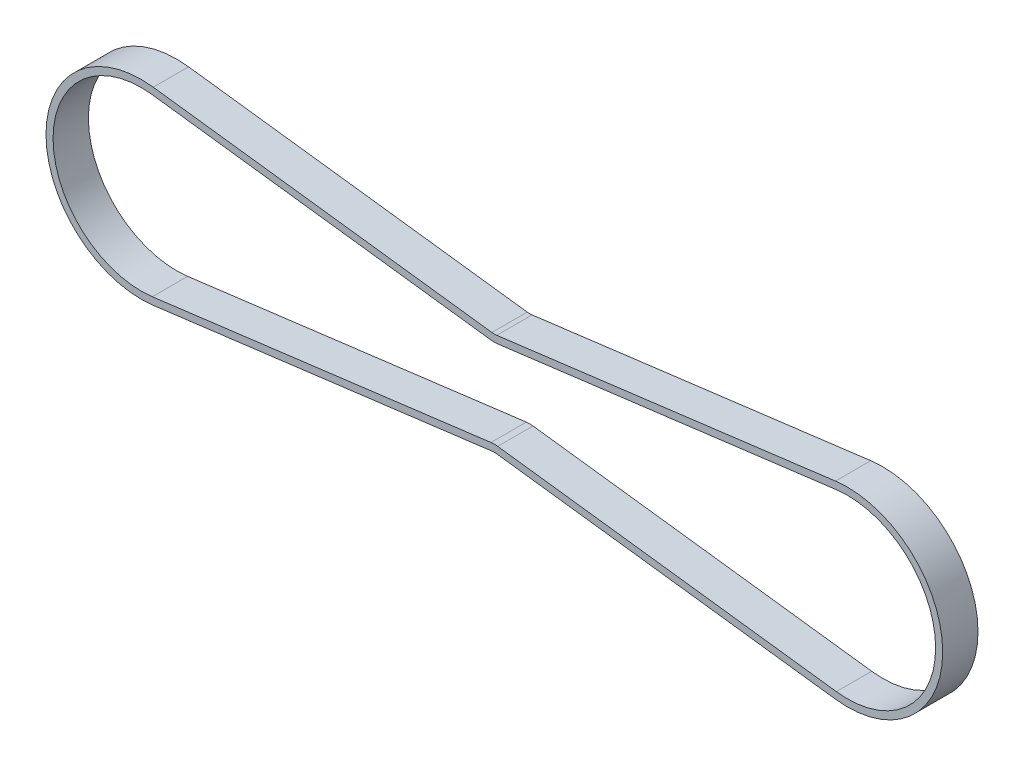
ISO-10303-21;
HEADER;
FILE_DESCRIPTION(('STEP AP214'),'2;1');
FILE_NAME('part.step','',(''),(''),'','','');
FILE_SCHEMA(('AUTOMOTIVE_DESIGN { 1 0 10303 214 1 1 1 1 }'));
ENDSEC;
DATA;
#1=APPLICATION_CONTEXT('core data for automotive mechanical design processes');
#2=APPLICATION_PROTOCOL_DEFINITION('international standard','automotive_design',2000,#1);
#3=PRODUCT_CONTEXT('',#1,'mechanical');
#4=PRODUCT('Part','Part','',(#3));
#5=PRODUCT_RELATED_PRODUCT_CATEGORY('part','',(#4));
#6=PRODUCT_DEFINITION_FORMATION('','',#4);
#7=PRODUCT_DEFINITION_CONTEXT('part definition',#1,'design');
#8=PRODUCT_DEFINITION('design','',#6,#7);
#9=PRODUCT_DEFINITION_SHAPE('','',#8);
#10=(LENGTH_UNIT() NAMED_UNIT(*) SI_UNIT(.MILLI.,.METRE.));
#11=(NAMED_UNIT(*) PLANE_ANGLE_UNIT() SI_UNIT($,.RADIAN.));
#12=(NAMED_UNIT(*) SI_UNIT($,.STERADIAN.) SOLID_ANGLE_UNIT());
#13=UNCERTAINTY_MEASURE_WITH_UNIT(LENGTH_MEASURE(1.E-05),#10,'distance_accuracy_value','');
#14=(GEOMETRIC_REPRESENTATION_CONTEXT(3) GLOBAL_UNCERTAINTY_ASSIGNED_CONTEXT((#13)) GLOBAL_UNIT_ASSIGNED_CONTEXT((#10,
#11,#12)) REPRESENTATION_CONTEXT('',''));
#15=CARTESIAN_POINT('',(0.,0.,0.));
#16=DIRECTION('',(0.,0.,1.));
#17=DIRECTION('',(1.,0.,0.));
#18=AXIS2_PLACEMENT_3D('',#15,#16,#17);
#19=CARTESIAN_POINT('',(100.,-1.38083988687754E-12,22.5));
#20=DIRECTION('',(0.,0.,1.));
#21=DIRECTION('',(1.,0.,0.));
#22=AXIS2_PLACEMENT_3D('',#19,#20,#21);
#23=PLANE('',#22);
#24=CARTESIAN_POINT('',(0.,-1.29757316003065E-12,22.5));
#25=DIRECTION('',(0.,0.,-1.));
#26=DIRECTION('',(-1.,0.,0.));
#27=AXIS2_PLACEMENT_3D('',#24,#25,#26);
#28=CIRCLE('',#27,24.964790894702);
#29=CARTESIAN_POINT('',(3.1517591927381,-24.765039842634,22.5));
#30=VERTEX_POINT('',#29);
#31=CARTESIAN_POINT('',(3.15175919273811,24.7650398426314,22.5));
#32=VERTEX_POINT('',#31);
#33=EDGE_CURVE('E262',#30,#32,#28,.T.);
#34=ORIENTED_EDGE('',*,*,#33,.T.);
#35=DIRECTION('',(0.99199868915739,-0.126248171115542,0.));
#36=VECTOR('',#35,1.);
#37=CARTESIAN_POINT('',(56.1572435558659,18.0192189730267,22.5));
#38=LINE('',#37,#36);
#39=CARTESIAN_POINT('',(99.0531387166334,12.5600098313182,22.5));
#40=VERTEX_POINT('',#39);
#41=EDGE_CURVE('E239',#32,#40,#38,.T.);
#42=ORIENTED_EDGE('',*,*,#41,.T.);
#43=CARTESIAN_POINT('',(100.,19.9999999999993,22.5));
#44=DIRECTION('',(0.,0.,1.));
#45=DIRECTION('',(1.,0.,0.));
#46=AXIS2_PLACEMENT_3D('',#43,#44,#45);
#47=CIRCLE('',#46,7.50000000000074);
#48=CARTESIAN_POINT('',(100.946861283367,12.5600098313182,22.5));
#49=VERTEX_POINT('',#48);
#50=EDGE_CURVE('E199',#40,#49,#47,.T.);
#51=ORIENTED_EDGE('',*,*,#50,.T.);
#52=DIRECTION('',(-0.99199868915739,-0.126248171115542,0.));
#53=VECTOR('',#52,1.);
#54=CARTESIAN_POINT('',(143.842756444134,18.0192189730267,22.5));
#55=LINE('',#54,#53);
#56=CARTESIAN_POINT('',(196.848240807262,24.7650398426314,22.5));
#57=VERTEX_POINT('',#56);
#58=EDGE_CURVE('E226',#57,#49,#55,.T.);
#59=ORIENTED_EDGE('',*,*,#58,.F.);
#60=CARTESIAN_POINT('',(200.,-1.37390099297363E-12,22.5));
#61=DIRECTION('',(0.,0.,1.));
#62=DIRECTION('',(1.,0.,0.));
#63=AXIS2_PLACEMENT_3D('',#60,#61,#62);
#64=CIRCLE('',#63,24.964790894702);
#65=CARTESIAN_POINT('',(196.848240807262,-24.7650398426341,22.5));
#66=VERTEX_POINT('',#65);
#67=EDGE_CURVE('E324',#66,#57,#64,.T.);
#68=ORIENTED_EDGE('',*,*,#67,.F.);
#69=DIRECTION('',(-0.99199868915739,0.126248171115542,0.));
#70=VECTOR('',#69,1.);
#71=CARTESIAN_POINT('',(143.842756444136,-18.0192189730298,22.5));
#72=LINE('',#71,#70);
#73=CARTESIAN_POINT('',(100.946861283367,-12.560009831321,22.5));
#74=VERTEX_POINT('',#73);
#75=EDGE_CURVE('E170',#66,#74,#72,.T.);
#76=ORIENTED_EDGE('',*,*,#75,.T.);
#77=CARTESIAN_POINT('',(100.,-20.0000000000014,22.5));
#78=DIRECTION('',(0.,0.,-1.));
#79=DIRECTION('',(1.,0.,0.));
#80=AXIS2_PLACEMENT_3D('',#77,#78,#79);
#81=CIRCLE('',#80,7.5);
#82=CARTESIAN_POINT('',(99.0531387166334,-12.560009831321,22.5));
#83=VERTEX_POINT('',#82);
#84=EDGE_CURVE('E141',#83,#74,#81,.T.);
#85=ORIENTED_EDGE('',*,*,#84,.F.);
#86=DIRECTION('',(0.99199868915739,0.126248171115542,0.));
#87=VECTOR('',#86,1.);
#88=CARTESIAN_POINT('',(56.1572435558641,-18.0192189730298,22.5));
#89=LINE('',#88,#87);
#90=EDGE_CURVE('E31',#30,#83,#89,.T.);
#91=ORIENTED_EDGE('',*,*,#90,.F.);
#92=EDGE_LOOP('',(#34,#42,#51,#59,#68,#76,#85,#91));
#93=FACE_BOUND('',#92,.T.);
#94=DIRECTION('',(0.99199868915739,-0.126248171115542,0.));
#95=VECTOR('',#94,1.);
#96=CARTESIAN_POINT('',(48.8258349601809,20.9683931593263,22.5));
#97=LINE('',#96,#95);
#98=CARTESIAN_POINT('',(3.40425553496915,26.7490372209468,22.5));
#99=VERTEX_POINT('',#98);
#100=CARTESIAN_POINT('',(99.3056350588646,14.544007209633,22.5));
#101=VERTEX_POINT('',#100);
#102=EDGE_CURVE('E256',#99,#101,#97,.T.);
#103=ORIENTED_EDGE('',*,*,#102,.F.);
#104=CARTESIAN_POINT('',(0.,-6.12522692698917E-13,22.5));
#105=DIRECTION('',(0.,0.,1.));
#106=DIRECTION('',(1.,0.,0.));
#107=AXIS2_PLACEMENT_3D('',#104,#105,#106);
#108=CIRCLE('',#107,26.964790894702);
#109=CARTESIAN_POINT('',(3.40425553496919,-26.7490372209489,22.5));
#110=VERTEX_POINT('',#109);
#111=EDGE_CURVE('E180',#99,#110,#108,.T.);
#112=ORIENTED_EDGE('',*,*,#111,.T.);
#113=DIRECTION('',(0.99199868915739,0.126248171115542,0.));
#114=VECTOR('',#113,1.);
#115=CARTESIAN_POINT('',(48.8258349601809,-20.9683931593291,22.5));
#116=LINE('',#115,#114);
#117=CARTESIAN_POINT('',(99.3056350588645,-14.5440072096357,22.5));
#118=VERTEX_POINT('',#117);
#119=EDGE_CURVE('E178',#110,#118,#116,.T.);
#120=ORIENTED_EDGE('',*,*,#119,.T.);
#121=CARTESIAN_POINT('',(100.,-20.0000000000013,22.5));
#122=DIRECTION('',(0.,0.,-1.));
#123=DIRECTION('',(1.,0.,0.));
#124=AXIS2_PLACEMENT_3D('',#121,#122,#123);
#125=CIRCLE('',#124,5.49999999999994);
#126=CARTESIAN_POINT('',(100.694364941135,-14.5440072096357,22.5));
#127=VERTEX_POINT('',#126);
#128=EDGE_CURVE('E283',#118,#127,#125,.T.);
#129=ORIENTED_EDGE('',*,*,#128,.T.);
#130=DIRECTION('',(-0.99199868915739,0.126248171115542,0.));
#131=VECTOR('',#130,1.);
#132=CARTESIAN_POINT('',(151.174165039819,-20.9683931593291,22.5));
#133=LINE('',#132,#131);
#134=CARTESIAN_POINT('',(196.595744465031,-26.7490372209489,22.5));
#135=VERTEX_POINT('',#134);
#136=EDGE_CURVE('E218',#135,#127,#133,.T.);
#137=ORIENTED_EDGE('',*,*,#136,.F.);
#138=CARTESIAN_POINT('',(200.,-4.44956571588051E-13,22.5));
#139=DIRECTION('',(0.,0.,1.));
#140=DIRECTION('',(1.,0.,0.));
#141=AXIS2_PLACEMENT_3D('',#138,#139,#140);
#142=CIRCLE('',#141,26.964790894702);
#143=CARTESIAN_POINT('',(196.595744465031,26.749037220947,22.5));
#144=VERTEX_POINT('',#143);
#145=EDGE_CURVE('E23',#135,#144,#142,.T.);
#146=ORIENTED_EDGE('',*,*,#145,.T.);
#147=DIRECTION('',(-0.99199868915739,-0.126248171115542,0.));
#148=VECTOR('',#147,1.);
#149=CARTESIAN_POINT('',(151.174165039819,20.9683931593263,22.5));
#150=LINE('',#149,#148);
#151=CARTESIAN_POINT('',(100.694364941135,14.544007209633,22.5));
#152=VERTEX_POINT('',#151);
#153=EDGE_CURVE('E202',#144,#152,#150,.T.);
#154=ORIENTED_EDGE('',*,*,#153,.T.);
#155=CARTESIAN_POINT('',(100.,19.9999999999992,22.5));
#156=DIRECTION('',(0.,0.,1.));
#157=DIRECTION('',(1.,0.,0.));
#158=AXIS2_PLACEMENT_3D('',#155,#156,#157);
#159=CIRCLE('',#158,5.5000000000006);
#160=EDGE_CURVE('E284',#101,#152,#159,.T.);
#161=ORIENTED_EDGE('',*,*,#160,.F.);
#162=EDGE_LOOP('',(#103,#112,#120,#129,#137,#146,#154,#161));
#163=FACE_BOUND('',#162,.T.);
#164=ADVANCED_FACE('F19',(#93,#163),#23,.T.);
#165=CARTESIAN_POINT('',(100.,-1.38083988687754E-12,12.5));
#166=DIRECTION('',(0.,0.,1.));
#167=DIRECTION('',(1.,0.,0.));
#168=AXIS2_PLACEMENT_3D('',#165,#166,#167);
#169=PLANE('',#168);
#170=CARTESIAN_POINT('',(0.,-1.29757316003065E-12,12.5));
#171=DIRECTION('',(0.,0.,-1.));
#172=DIRECTION('',(-1.,0.,0.));
#173=AXIS2_PLACEMENT_3D('',#170,#171,#172);
#174=CIRCLE('',#173,24.964790894702);
#175=CARTESIAN_POINT('',(3.1517591927381,-24.765039842634,12.5));
#176=VERTEX_POINT('',#175);
#177=CARTESIAN_POINT('',(3.15175919273811,24.7650398426314,12.5));
#178=VERTEX_POINT('',#177);
#179=EDGE_CURVE('E261',#176,#178,#174,.T.);
#180=ORIENTED_EDGE('',*,*,#179,.F.);
#181=DIRECTION('',(0.99199868915739,0.126248171115542,0.));
#182=VECTOR('',#181,1.);
#183=CARTESIAN_POINT('',(56.1572435558641,-18.0192189730298,12.5));
#184=LINE('',#183,#182);
#185=CARTESIAN_POINT('',(99.0531387166334,-12.560009831321,12.5));
#186=VERTEX_POINT('',#185);
#187=EDGE_CURVE('E12',#176,#186,#184,.T.);
#188=ORIENTED_EDGE('',*,*,#187,.T.);
#189=CARTESIAN_POINT('',(100.,-20.0000000000014,12.5));
#190=DIRECTION('',(0.,0.,-1.));
#191=DIRECTION('',(1.,0.,0.));
#192=AXIS2_PLACEMENT_3D('',#189,#190,#191);
#193=CIRCLE('',#192,7.5);
#194=CARTESIAN_POINT('',(100.946861283367,-12.560009831321,12.5));
#195=VERTEX_POINT('',#194);
#196=EDGE_CURVE('E148',#186,#195,#193,.T.);
#197=ORIENTED_EDGE('',*,*,#196,.T.);
#198=DIRECTION('',(-0.99199868915739,0.126248171115542,0.));
#199=VECTOR('',#198,1.);
#200=CARTESIAN_POINT('',(143.842756444136,-18.0192189730298,12.5));
#201=LINE('',#200,#199);
#202=CARTESIAN_POINT('',(196.848240807262,-24.7650398426341,12.5));
#203=VERTEX_POINT('',#202);
#204=EDGE_CURVE('E152',#203,#195,#201,.T.);
#205=ORIENTED_EDGE('',*,*,#204,.F.);
#206=CARTESIAN_POINT('',(200.,-1.37390099297363E-12,12.5));
#207=DIRECTION('',(0.,0.,1.));
#208=DIRECTION('',(1.,0.,0.));
#209=AXIS2_PLACEMENT_3D('',#206,#207,#208);
#210=CIRCLE('',#209,24.964790894702);
#211=CARTESIAN_POINT('',(196.848240807262,24.7650398426314,12.5));
#212=VERTEX_POINT('',#211);
#213=EDGE_CURVE('E291',#203,#212,#210,.T.);
#214=ORIENTED_EDGE('',*,*,#213,.T.);
#215=DIRECTION('',(-0.99199868915739,-0.126248171115542,0.));
#216=VECTOR('',#215,1.);
#217=CARTESIAN_POINT('',(143.842756444134,18.0192189730267,12.5));
#218=LINE('',#217,#216);
#219=CARTESIAN_POINT('',(100.946861283367,12.5600098313182,12.5));
#220=VERTEX_POINT('',#219);
#221=EDGE_CURVE('E187',#212,#220,#218,.T.);
#222=ORIENTED_EDGE('',*,*,#221,.T.);
#223=CARTESIAN_POINT('',(100.,19.9999999999993,12.5));
#224=DIRECTION('',(0.,0.,1.));
#225=DIRECTION('',(1.,0.,0.));
#226=AXIS2_PLACEMENT_3D('',#223,#224,#225);
#227=CIRCLE('',#226,7.50000000000074);
#228=CARTESIAN_POINT('',(99.0531387166334,12.5600098313182,12.5));
#229=VERTEX_POINT('',#228);
#230=EDGE_CURVE('E277',#229,#220,#227,.T.);
#231=ORIENTED_EDGE('',*,*,#230,.F.);
#232=DIRECTION('',(0.99199868915739,-0.126248171115542,0.));
#233=VECTOR('',#232,1.);
#234=CARTESIAN_POINT('',(56.1572435558659,18.0192189730267,12.5));
#235=LINE('',#234,#233);
#236=EDGE_CURVE('E244',#178,#229,#235,.T.);
#237=ORIENTED_EDGE('',*,*,#236,.F.);
#238=EDGE_LOOP('',(#180,#188,#197,#205,#214,#222,#231,#237));
#239=FACE_BOUND('',#238,.T.);
#240=DIRECTION('',(0.99199868915739,-0.126248171115542,0.));
#241=VECTOR('',#240,1.);
#242=CARTESIAN_POINT('',(48.8258349601809,20.9683931593263,12.5));
#243=LINE('',#242,#241);
#244=CARTESIAN_POINT('',(3.40425553496915,26.7490372209468,12.5));
#245=VERTEX_POINT('',#244);
#246=CARTESIAN_POINT('',(99.3056350588646,14.544007209633,12.5));
#247=VERTEX_POINT('',#246);
#248=EDGE_CURVE('E255',#245,#247,#243,.T.);
#249=ORIENTED_EDGE('',*,*,#248,.T.);
#250=CARTESIAN_POINT('',(100.,19.9999999999992,12.5));
#251=DIRECTION('',(0.,0.,1.));
#252=DIRECTION('',(1.,0.,0.));
#253=AXIS2_PLACEMENT_3D('',#250,#251,#252);
#254=CIRCLE('',#253,5.5000000000006);
#255=CARTESIAN_POINT('',(100.694364941135,14.544007209633,12.5));
#256=VERTEX_POINT('',#255);
#257=EDGE_CURVE('E45',#247,#256,#254,.T.);
#258=ORIENTED_EDGE('',*,*,#257,.T.);
#259=DIRECTION('',(-0.99199868915739,-0.126248171115542,0.));
#260=VECTOR('',#259,1.);
#261=CARTESIAN_POINT('',(151.174165039819,20.9683931593263,12.5));
#262=LINE('',#261,#260);
#263=CARTESIAN_POINT('',(196.595744465031,26.749037220947,12.5));
#264=VERTEX_POINT('',#263);
#265=EDGE_CURVE('E207',#264,#256,#262,.T.);
#266=ORIENTED_EDGE('',*,*,#265,.F.);
#267=CARTESIAN_POINT('',(200.,-4.44956571588051E-13,12.5));
#268=DIRECTION('',(0.,0.,1.));
#269=DIRECTION('',(1.,0.,0.));
#270=AXIS2_PLACEMENT_3D('',#267,#268,#269);
#271=CIRCLE('',#270,26.964790894702);
#272=CARTESIAN_POINT('',(196.595744465031,-26.7490372209489,12.5));
#273=VERTEX_POINT('',#272);
#274=EDGE_CURVE('E385',#273,#264,#271,.T.);
#275=ORIENTED_EDGE('',*,*,#274,.F.);
#276=DIRECTION('',(-0.99199868915739,0.126248171115542,0.));
#277=VECTOR('',#276,1.);
#278=CARTESIAN_POINT('',(151.174165039819,-20.9683931593291,12.5));
#279=LINE('',#278,#277);
#280=CARTESIAN_POINT('',(100.694364941135,-14.5440072096357,12.5));
#281=VERTEX_POINT('',#280);
#282=EDGE_CURVE('E223',#273,#281,#279,.T.);
#283=ORIENTED_EDGE('',*,*,#282,.T.);
#284=CARTESIAN_POINT('',(100.,-20.0000000000013,12.5));
#285=DIRECTION('',(0.,0.,-1.));
#286=DIRECTION('',(1.,0.,0.));
#287=AXIS2_PLACEMENT_3D('',#284,#285,#286);
#288=CIRCLE('',#287,5.49999999999994);
#289=CARTESIAN_POINT('',(99.3056350588645,-14.5440072096357,12.5));
#290=VERTEX_POINT('',#289);
#291=EDGE_CURVE('E316',#290,#281,#288,.T.);
#292=ORIENTED_EDGE('',*,*,#291,.F.);
#293=DIRECTION('',(0.99199868915739,0.126248171115542,0.));
#294=VECTOR('',#293,1.);
#295=CARTESIAN_POINT('',(48.8258349601809,-20.9683931593291,12.5));
#296=LINE('',#295,#294);
#297=CARTESIAN_POINT('',(3.40425553496919,-26.7490372209489,12.5));
#298=VERTEX_POINT('',#297);
#299=EDGE_CURVE('E246',#298,#290,#296,.T.);
#300=ORIENTED_EDGE('',*,*,#299,.F.);
#301=CARTESIAN_POINT('',(0.,-6.12522692698917E-13,12.5));
#302=DIRECTION('',(0.,0.,1.));
#303=DIRECTION('',(1.,0.,0.));
#304=AXIS2_PLACEMENT_3D('',#301,#302,#303);
#305=CIRCLE('',#304,26.964790894702);
#306=EDGE_CURVE('E185',#245,#298,#305,.T.);
#307=ORIENTED_EDGE('',*,*,#306,.F.);
#308=EDGE_LOOP('',(#249,#258,#266,#275,#283,#292,#300,#307));
#309=FACE_BOUND('',#308,.T.);
#310=ADVANCED_FACE('F150',(#239,#309),#169,.F.);
#311=CARTESIAN_POINT('',(56.1572435558641,-18.0192189730298,12.5));
#312=DIRECTION('',(0.126248171115542,-0.99199868915739,0.));
#313=DIRECTION('',(0.,0.,-1.));
#314=AXIS2_PLACEMENT_3D('',#311,#312,#313);
#315=PLANE('',#314);
#316=ORIENTED_EDGE('',*,*,#90,.T.);
#317=DIRECTION('',(0.,0.,1.));
#318=VECTOR('',#317,1.);
#319=CARTESIAN_POINT('',(99.0531387166334,-12.560009831321,12.5));
#320=LINE('',#319,#318);
#321=EDGE_CURVE('E157',#186,#83,#320,.T.);
#322=ORIENTED_EDGE('',*,*,#321,.F.);
#323=ORIENTED_EDGE('',*,*,#187,.F.);
#324=DIRECTION('',(0.,0.,1.));
#325=VECTOR('',#324,1.);
#326=CARTESIAN_POINT('',(3.1517591927381,-24.765039842634,12.5));
#327=LINE('',#326,#325);
#328=EDGE_CURVE('E257',#176,#30,#327,.T.);
#329=ORIENTED_EDGE('',*,*,#328,.T.);
#330=EDGE_LOOP('',(#316,#322,#323,#329));
#331=FACE_BOUND('',#330,.T.);
#332=ADVANCED_FACE('F486',(#331),#315,.F.);
#333=CARTESIAN_POINT('',(100.,19.9999999999992,12.5));
#334=DIRECTION('',(0.,0.,1.));
#335=DIRECTION('',(1.,0.,0.));
#336=AXIS2_PLACEMENT_3D('',#333,#334,#335);
#337=CYLINDRICAL_SURFACE('',#336,5.5000000000006);
#338=ORIENTED_EDGE('',*,*,#160,.T.);
#339=DIRECTION('',(0.,0.,1.));
#340=VECTOR('',#339,1.);
#341=CARTESIAN_POINT('',(100.694364941135,14.544007209633,12.5));
#342=LINE('',#341,#340);
#343=EDGE_CURVE('E288',#256,#152,#342,.T.);
#344=ORIENTED_EDGE('',*,*,#343,.F.);
#345=ORIENTED_EDGE('',*,*,#257,.F.);
#346=DIRECTION('',(0.,0.,1.));
#347=VECTOR('',#346,1.);
#348=CARTESIAN_POINT('',(99.3056350588646,14.544007209633,12.5));
#349=LINE('',#348,#347);
#350=EDGE_CURVE('E251',#247,#101,#349,.T.);
#351=ORIENTED_EDGE('',*,*,#350,.T.);
#352=EDGE_LOOP('',(#338,#344,#345,#351));
#353=FACE_BOUND('',#352,.T.);
#354=ADVANCED_FACE('F503',(#353),#337,.F.);
#355=CARTESIAN_POINT('',(151.174165039819,20.9683931593263,12.5));
#356=DIRECTION('',(-0.126248171115542,0.99199868915739,0.));
#357=DIRECTION('',(0.,0.,1.));
#358=AXIS2_PLACEMENT_3D('',#355,#356,#357);
#359=PLANE('',#358);
#360=ORIENTED_EDGE('',*,*,#153,.F.);
#361=DIRECTION('',(0.,0.,1.));
#362=VECTOR('',#361,1.);
#363=CARTESIAN_POINT('',(196.595744465031,26.749037220947,12.5));
#364=LINE('',#363,#362);
#365=EDGE_CURVE('E208',#264,#144,#364,.T.);
#366=ORIENTED_EDGE('',*,*,#365,.F.);
#367=ORIENTED_EDGE('',*,*,#265,.T.);
#368=ORIENTED_EDGE('',*,*,#343,.T.);
#369=EDGE_LOOP('',(#360,#366,#367,#368));
#370=FACE_BOUND('',#369,.T.);
#371=ADVANCED_FACE('F513',(#370),#359,.T.);
#372=CARTESIAN_POINT('',(200.,-4.44956571588051E-13,12.5));
#373=DIRECTION('',(0.,0.,1.));
#374=DIRECTION('',(1.,0.,0.));
#375=AXIS2_PLACEMENT_3D('',#372,#373,#374);
#376=CYLINDRICAL_SURFACE('',#375,26.964790894702);
#377=ORIENTED_EDGE('',*,*,#145,.F.);
#378=DIRECTION('',(0.,0.,1.));
#379=VECTOR('',#378,1.);
#380=CARTESIAN_POINT('',(196.595744465031,-26.7490372209489,12.5));
#381=LINE('',#380,#379);
#382=EDGE_CURVE('E342',#273,#135,#381,.T.);
#383=ORIENTED_EDGE('',*,*,#382,.F.);
#384=ORIENTED_EDGE('',*,*,#274,.T.);
#385=ORIENTED_EDGE('',*,*,#365,.T.);
#386=EDGE_LOOP('',(#377,#383,#384,#385));
#387=FACE_BOUND('',#386,.T.);
#388=ADVANCED_FACE('F507',(#387),#376,.T.);
#389=CARTESIAN_POINT('',(151.174165039819,-20.9683931593291,12.5));
#390=DIRECTION('',(0.126248171115542,0.99199868915739,0.));
#391=DIRECTION('',(0.,0.,-1.));
#392=AXIS2_PLACEMENT_3D('',#389,#390,#391);
#393=PLANE('',#392);
#394=ORIENTED_EDGE('',*,*,#136,.T.);
#395=DIRECTION('',(0.,0.,1.));
#396=VECTOR('',#395,1.);
#397=CARTESIAN_POINT('',(100.694364941135,-14.5440072096357,12.5));
#398=LINE('',#397,#396);
#399=EDGE_CURVE('E224',#281,#127,#398,.T.);
#400=ORIENTED_EDGE('',*,*,#399,.F.);
#401=ORIENTED_EDGE('',*,*,#282,.F.);
#402=ORIENTED_EDGE('',*,*,#382,.T.);
#403=EDGE_LOOP('',(#394,#400,#401,#402));
#404=FACE_BOUND('',#403,.T.);
#405=ADVANCED_FACE('F505',(#404),#393,.F.);
#406=CARTESIAN_POINT('',(100.,-20.0000000000013,12.5));
#407=DIRECTION('',(0.,0.,1.));
#408=DIRECTION('',(1.,0.,0.));
#409=AXIS2_PLACEMENT_3D('',#406,#407,#408);
#410=CYLINDRICAL_SURFACE('',#409,5.49999999999994);
#411=ORIENTED_EDGE('',*,*,#128,.F.);
#412=DIRECTION('',(0.,0.,1.));
#413=VECTOR('',#412,1.);
#414=CARTESIAN_POINT('',(99.3056350588645,-14.5440072096357,12.5));
#415=LINE('',#414,#413);
#416=EDGE_CURVE('E250',#290,#118,#415,.T.);
#417=ORIENTED_EDGE('',*,*,#416,.F.);
#418=ORIENTED_EDGE('',*,*,#291,.T.);
#419=ORIENTED_EDGE('',*,*,#399,.T.);
#420=EDGE_LOOP('',(#411,#417,#418,#419));
#421=FACE_BOUND('',#420,.T.);
#422=ADVANCED_FACE('F21',(#421),#410,.F.);
#423=CARTESIAN_POINT('',(48.8258349601809,-20.9683931593291,12.5));
#424=DIRECTION('',(0.126248171115542,-0.99199868915739,0.));
#425=DIRECTION('',(0.,0.,-1.));
#426=AXIS2_PLACEMENT_3D('',#423,#424,#425);
#427=PLANE('',#426);
#428=ORIENTED_EDGE('',*,*,#119,.F.);
#429=DIRECTION('',(0.,0.,1.));
#430=VECTOR('',#429,1.);
#431=CARTESIAN_POINT('',(3.40425553496919,-26.7490372209489,12.5));
#432=LINE('',#431,#430);
#433=EDGE_CURVE('E232',#298,#110,#432,.T.);
#434=ORIENTED_EDGE('',*,*,#433,.F.);
#435=ORIENTED_EDGE('',*,*,#299,.T.);
#436=ORIENTED_EDGE('',*,*,#416,.T.);
#437=EDGE_LOOP('',(#428,#434,#435,#436));
#438=FACE_BOUND('',#437,.T.);
#439=ADVANCED_FACE('F310',(#438),#427,.T.);
#440=CARTESIAN_POINT('',(0.,-6.12522692698917E-13,12.5));
#441=DIRECTION('',(0.,0.,1.));
#442=DIRECTION('',(1.,0.,0.));
#443=AXIS2_PLACEMENT_3D('',#440,#441,#442);
#444=CYLINDRICAL_SURFACE('',#443,26.964790894702);
#445=ORIENTED_EDGE('',*,*,#111,.F.);
#446=DIRECTION('',(0.,0.,1.));
#447=VECTOR('',#446,1.);
#448=CARTESIAN_POINT('',(3.40425553496915,26.7490372209468,12.5));
#449=LINE('',#448,#447);
#450=EDGE_CURVE('E186',#245,#99,#449,.T.);
#451=ORIENTED_EDGE('',*,*,#450,.F.);
#452=ORIENTED_EDGE('',*,*,#306,.T.);
#453=ORIENTED_EDGE('',*,*,#433,.T.);
#454=EDGE_LOOP('',(#445,#451,#452,#453));
#455=FACE_BOUND('',#454,.T.);
#456=ADVANCED_FACE('F572',(#455),#444,.T.);
#457=CARTESIAN_POINT('',(48.8258349601809,20.9683931593263,12.5));
#458=DIRECTION('',(-0.126248171115542,-0.99199868915739,0.));
#459=DIRECTION('',(-0.99199868915739,0.126248171115542,0.));
#460=AXIS2_PLACEMENT_3D('',#457,#458,#459);
#461=PLANE('',#460);
#462=ORIENTED_EDGE('',*,*,#102,.T.);
#463=ORIENTED_EDGE('',*,*,#350,.F.);
#464=ORIENTED_EDGE('',*,*,#248,.F.);
#465=ORIENTED_EDGE('',*,*,#450,.T.);
#466=EDGE_LOOP('',(#462,#463,#464,#465));
#467=FACE_BOUND('',#466,.T.);
#468=ADVANCED_FACE('F567',(#467),#461,.F.);
#469=CARTESIAN_POINT('',(100.,-20.0000000000014,12.5));
#470=DIRECTION('',(0.,0.,1.));
#471=DIRECTION('',(1.,0.,0.));
#472=AXIS2_PLACEMENT_3D('',#469,#470,#471);
#473=CYLINDRICAL_SURFACE('',#472,7.5);
#474=ORIENTED_EDGE('',*,*,#84,.T.);
#475=DIRECTION('',(0.,0.,1.));
#476=VECTOR('',#475,1.);
#477=CARTESIAN_POINT('',(100.946861283367,-12.560009831321,12.5));
#478=LINE('',#477,#476);
#479=EDGE_CURVE('E159',#195,#74,#478,.T.);
#480=ORIENTED_EDGE('',*,*,#479,.F.);
#481=ORIENTED_EDGE('',*,*,#196,.F.);
#482=ORIENTED_EDGE('',*,*,#321,.T.);
#483=EDGE_LOOP('',(#474,#480,#481,#482));
#484=FACE_BOUND('',#483,.T.);
#485=ADVANCED_FACE('F160',(#484),#473,.T.);
#486=CARTESIAN_POINT('',(143.842756444136,-18.0192189730298,12.5));
#487=DIRECTION('',(0.126248171115542,0.99199868915739,0.));
#488=DIRECTION('',(0.,0.,-1.));
#489=AXIS2_PLACEMENT_3D('',#486,#487,#488);
#490=PLANE('',#489);
#491=ORIENTED_EDGE('',*,*,#75,.F.);
#492=DIRECTION('',(0.,0.,1.));
#493=VECTOR('',#492,1.);
#494=CARTESIAN_POINT('',(196.848240807262,-24.7650398426341,12.5));
#495=LINE('',#494,#493);
#496=EDGE_CURVE('E167',#203,#66,#495,.T.);
#497=ORIENTED_EDGE('',*,*,#496,.F.);
#498=ORIENTED_EDGE('',*,*,#204,.T.);
#499=ORIENTED_EDGE('',*,*,#479,.T.);
#500=EDGE_LOOP('',(#491,#497,#498,#499));
#501=FACE_BOUND('',#500,.T.);
#502=ADVANCED_FACE('F165',(#501),#490,.T.);
#503=CARTESIAN_POINT('',(200.,-1.37390099297363E-12,12.5));
#504=DIRECTION('',(0.,0.,1.));
#505=DIRECTION('',(1.,0.,0.));
#506=AXIS2_PLACEMENT_3D('',#503,#504,#505);
#507=CYLINDRICAL_SURFACE('',#506,24.964790894702);
#508=ORIENTED_EDGE('',*,*,#67,.T.);
#509=DIRECTION('',(0.,0.,1.));
#510=VECTOR('',#509,1.);
#511=CARTESIAN_POINT('',(196.848240807262,24.7650398426314,12.5));
#512=LINE('',#511,#510);
#513=EDGE_CURVE('E338',#212,#57,#512,.T.);
#514=ORIENTED_EDGE('',*,*,#513,.F.);
#515=ORIENTED_EDGE('',*,*,#213,.F.);
#516=ORIENTED_EDGE('',*,*,#496,.T.);
#517=EDGE_LOOP('',(#508,#514,#515,#516));
#518=FACE_BOUND('',#517,.T.);
#519=ADVANCED_FACE('F483',(#518),#507,.F.);
#520=CARTESIAN_POINT('',(143.842756444134,18.0192189730267,12.5));
#521=DIRECTION('',(-0.126248171115542,0.99199868915739,0.));
#522=DIRECTION('',(0.,0.,1.));
#523=AXIS2_PLACEMENT_3D('',#520,#521,#522);
#524=PLANE('',#523);
#525=ORIENTED_EDGE('',*,*,#58,.T.);
#526=DIRECTION('',(0.,0.,1.));
#527=VECTOR('',#526,1.);
#528=CARTESIAN_POINT('',(100.946861283367,12.5600098313182,12.5));
#529=LINE('',#528,#527);
#530=EDGE_CURVE('E231',#220,#49,#529,.T.);
#531=ORIENTED_EDGE('',*,*,#530,.F.);
#532=ORIENTED_EDGE('',*,*,#221,.F.);
#533=ORIENTED_EDGE('',*,*,#513,.T.);
#534=EDGE_LOOP('',(#525,#531,#532,#533));
#535=FACE_BOUND('',#534,.T.);
#536=ADVANCED_FACE('F479',(#535),#524,.F.);
#537=CARTESIAN_POINT('',(100.,19.9999999999993,12.5));
#538=DIRECTION('',(0.,0.,1.));
#539=DIRECTION('',(1.,0.,0.));
#540=AXIS2_PLACEMENT_3D('',#537,#538,#539);
#541=CYLINDRICAL_SURFACE('',#540,7.50000000000074);
#542=ORIENTED_EDGE('',*,*,#50,.F.);
#543=DIRECTION('',(0.,0.,1.));
#544=VECTOR('',#543,1.);
#545=CARTESIAN_POINT('',(99.0531387166334,12.5600098313182,12.5));
#546=LINE('',#545,#544);
#547=EDGE_CURVE('E353',#229,#40,#546,.T.);
#548=ORIENTED_EDGE('',*,*,#547,.F.);
#549=ORIENTED_EDGE('',*,*,#230,.T.);
#550=ORIENTED_EDGE('',*,*,#530,.T.);
#551=EDGE_LOOP('',(#542,#548,#549,#550));
#552=FACE_BOUND('',#551,.T.);
#553=ADVANCED_FACE('F468',(#552),#541,.T.);
#554=CARTESIAN_POINT('',(56.1572435558659,18.0192189730267,12.5));
#555=DIRECTION('',(-0.126248171115542,-0.99199868915739,0.));
#556=DIRECTION('',(-0.99199868915739,0.126248171115542,0.));
#557=AXIS2_PLACEMENT_3D('',#554,#555,#556);
#558=PLANE('',#557);
#559=ORIENTED_EDGE('',*,*,#41,.F.);
#560=DIRECTION('',(0.,0.,1.));
#561=VECTOR('',#560,1.);
#562=CARTESIAN_POINT('',(3.15175919273811,24.7650398426314,12.5));
#563=LINE('',#562,#561);
#564=EDGE_CURVE('E245',#178,#32,#563,.T.);
#565=ORIENTED_EDGE('',*,*,#564,.F.);
#566=ORIENTED_EDGE('',*,*,#236,.T.);
#567=ORIENTED_EDGE('',*,*,#547,.T.);
#568=EDGE_LOOP('',(#559,#565,#566,#567));
#569=FACE_BOUND('',#568,.T.);
#570=ADVANCED_FACE('F473',(#569),#558,.T.);
#571=CARTESIAN_POINT('',(0.,-1.29757316003065E-12,12.5));
#572=DIRECTION('',(0.,0.,1.));
#573=DIRECTION('',(1.,0.,0.));
#574=AXIS2_PLACEMENT_3D('',#571,#572,#573);
#575=CYLINDRICAL_SURFACE('',#574,24.964790894702);
#576=ORIENTED_EDGE('',*,*,#33,.F.);
#577=ORIENTED_EDGE('',*,*,#328,.F.);
#578=ORIENTED_EDGE('',*,*,#179,.T.);
#579=ORIENTED_EDGE('',*,*,#564,.T.);
#580=EDGE_LOOP('',(#576,#577,#578,#579));
#581=FACE_BOUND('',#580,.T.);
#582=ADVANCED_FACE('F488',(#581),#575,.F.);
#583=CLOSED_SHELL('',(#164,#310,#332,#354,#371,#388,#405,#422,#439,#456,#468,#485,#502,#519,
#536,#553,#570,#582));
#584=MANIFOLD_SOLID_BREP('B1',#583);
#585=ADVANCED_BREP_SHAPE_REPRESENTATION('',(#18,#584),#14);
#586=SHAPE_DEFINITION_REPRESENTATION(#9,#585);
ENDSEC;
END-ISO-10303-21;
